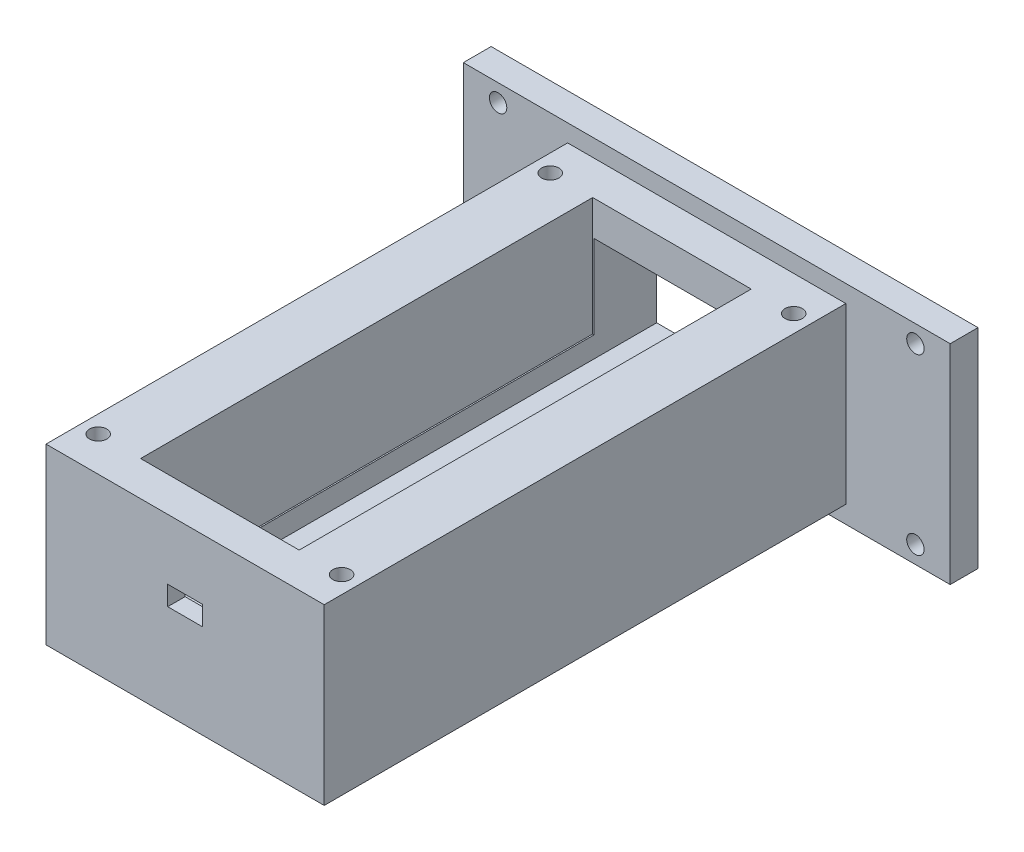
ISO-10303-21;
HEADER;
FILE_DESCRIPTION(('STEP AP214'),'2;1');
FILE_NAME('part.step','',(''),(''),'','','');
FILE_SCHEMA(('AUTOMOTIVE_DESIGN { 1 0 10303 214 1 1 1 1 }'));
ENDSEC;
DATA;
#1=APPLICATION_CONTEXT('core data for automotive mechanical design processes');
#2=APPLICATION_PROTOCOL_DEFINITION('international standard','automotive_design',2000,#1);
#3=PRODUCT_CONTEXT('',#1,'mechanical');
#4=PRODUCT('Part','Part','',(#3));
#5=PRODUCT_RELATED_PRODUCT_CATEGORY('part','',(#4));
#6=PRODUCT_DEFINITION_FORMATION('','',#4);
#7=PRODUCT_DEFINITION_CONTEXT('part definition',#1,'design');
#8=PRODUCT_DEFINITION('design','',#6,#7);
#9=PRODUCT_DEFINITION_SHAPE('','',#8);
#10=(LENGTH_UNIT() NAMED_UNIT(*) SI_UNIT(.MILLI.,.METRE.));
#11=(NAMED_UNIT(*) PLANE_ANGLE_UNIT() SI_UNIT($,.RADIAN.));
#12=(NAMED_UNIT(*) SI_UNIT($,.STERADIAN.) SOLID_ANGLE_UNIT());
#13=UNCERTAINTY_MEASURE_WITH_UNIT(LENGTH_MEASURE(1.E-05),#10,'distance_accuracy_value','');
#14=(GEOMETRIC_REPRESENTATION_CONTEXT(3) GLOBAL_UNCERTAINTY_ASSIGNED_CONTEXT((#13)) GLOBAL_UNIT_ASSIGNED_CONTEXT((#10,
#11,#12)) REPRESENTATION_CONTEXT('',''));
#15=CARTESIAN_POINT('',(0.,0.,0.));
#16=DIRECTION('',(0.,0.,1.));
#17=DIRECTION('',(1.,0.,0.));
#18=AXIS2_PLACEMENT_3D('',#15,#16,#17);
#19=CARTESIAN_POINT('',(22.4109534045464,10.3125,76.5));
#20=DIRECTION('',(0.,1.,0.));
#21=DIRECTION('',(0.,0.,1.));
#22=AXIS2_PLACEMENT_3D('',#19,#20,#21);
#23=PLANE('',#22);
#24=DIRECTION('',(0.,0.,-1.));
#25=VECTOR('',#24,1.);
#26=CARTESIAN_POINT('',(22.4109534045464,10.3125,76.5));
#27=LINE('',#26,#25);
#28=CARTESIAN_POINT('',(22.4109534045464,10.3125,8.99999999999999));
#29=VERTEX_POINT('',#28);
#30=CARTESIAN_POINT('',(22.4109534045464,10.3125,0.));
#31=VERTEX_POINT('',#30);
#32=EDGE_CURVE('E334',#29,#31,#27,.T.);
#33=ORIENTED_EDGE('',*,*,#32,.F.);
#34=DIRECTION('',(-1.,0.,0.));
#35=VECTOR('',#34,1.);
#36=CARTESIAN_POINT('',(22.4109534045464,10.3125,8.99999999999999));
#37=LINE('',#36,#35);
#38=CARTESIAN_POINT('',(0.0109534045463731,10.3125,8.99999999999999));
#39=VERTEX_POINT('',#38);
#40=EDGE_CURVE('E300',#29,#39,#37,.T.);
#41=ORIENTED_EDGE('',*,*,#40,.T.);
#42=DIRECTION('',(0.,0.,-1.));
#43=VECTOR('',#42,1.);
#44=CARTESIAN_POINT('',(0.0109534045463731,10.3125,76.5));
#45=LINE('',#44,#43);
#46=CARTESIAN_POINT('',(0.0109534045463731,10.3125,0.));
#47=VERTEX_POINT('',#46);
#48=EDGE_CURVE('E338',#39,#47,#45,.T.);
#49=ORIENTED_EDGE('',*,*,#48,.T.);
#50=DIRECTION('',(1.,0.,0.));
#51=VECTOR('',#50,1.);
#52=CARTESIAN_POINT('',(22.4109534045464,10.3125,0.));
#53=LINE('',#52,#51);
#54=EDGE_CURVE('E311',#47,#31,#53,.T.);
#55=ORIENTED_EDGE('',*,*,#54,.T.);
#56=EDGE_LOOP('',(#33,#41,#49,#55));
#57=FACE_BOUND('',#56,.T.);
#58=ADVANCED_FACE('F43',(#57),#23,.F.);
#59=CARTESIAN_POINT('',(46.2109534045464,0.,4.));
#60=DIRECTION('',(1.,0.,0.));
#61=DIRECTION('',(0.,0.,-1.));
#62=AXIS2_PLACEMENT_3D('',#59,#60,#61);
#63=PLANE('',#62);
#64=DIRECTION('',(0.,-1.,0.));
#65=VECTOR('',#64,1.);
#66=CARTESIAN_POINT('',(46.2109534045464,0.,0.));
#67=LINE('',#66,#65);
#68=CARTESIAN_POINT('',(46.2109534045464,17.8125,0.));
#69=VERTEX_POINT('',#68);
#70=CARTESIAN_POINT('',(46.2109534045464,-12.1875,0.));
#71=VERTEX_POINT('',#70);
#72=EDGE_CURVE('E375',#69,#71,#67,.T.);
#73=ORIENTED_EDGE('',*,*,#72,.F.);
#74=DIRECTION('',(0.,0.,-1.));
#75=VECTOR('',#74,1.);
#76=CARTESIAN_POINT('',(46.2109534045464,17.8125,4.));
#77=LINE('',#76,#75);
#78=CARTESIAN_POINT('',(46.2109534045464,17.8125,4.));
#79=VERTEX_POINT('',#78);
#80=EDGE_CURVE('E403',#79,#69,#77,.T.);
#81=ORIENTED_EDGE('',*,*,#80,.F.);
#82=DIRECTION('',(0.,-1.,0.));
#83=VECTOR('',#82,1.);
#84=CARTESIAN_POINT('',(46.2109534045464,0.,4.));
#85=LINE('',#84,#83);
#86=CARTESIAN_POINT('',(46.2109534045464,-12.1875,4.));
#87=VERTEX_POINT('',#86);
#88=EDGE_CURVE('E376',#79,#87,#85,.T.);
#89=ORIENTED_EDGE('',*,*,#88,.T.);
#90=DIRECTION('',(0.,0.,-1.));
#91=VECTOR('',#90,1.);
#92=CARTESIAN_POINT('',(46.2109534045464,-12.1875,4.));
#93=LINE('',#92,#91);
#94=EDGE_CURVE('E387',#87,#71,#93,.T.);
#95=ORIENTED_EDGE('',*,*,#94,.T.);
#96=EDGE_LOOP('',(#73,#81,#89,#95));
#97=FACE_BOUND('',#96,.T.);
#98=ADVANCED_FACE('F45',(#97),#63,.T.);
#99=CARTESIAN_POINT('',(0.,17.8125,4.));
#100=DIRECTION('',(0.,1.,0.));
#101=DIRECTION('',(0.,0.,1.));
#102=AXIS2_PLACEMENT_3D('',#99,#100,#101);
#103=PLANE('',#102);
#104=DIRECTION('',(1.,0.,0.));
#105=VECTOR('',#104,1.);
#106=CARTESIAN_POINT('',(0.,17.8125,0.));
#107=LINE('',#106,#105);
#108=CARTESIAN_POINT('',(-23.7890465954536,17.8125,0.));
#109=VERTEX_POINT('',#108);
#110=EDGE_CURVE('E390',#109,#69,#107,.T.);
#111=ORIENTED_EDGE('',*,*,#110,.F.);
#112=DIRECTION('',(0.,0.,-1.));
#113=VECTOR('',#112,1.);
#114=CARTESIAN_POINT('',(-23.7890465954536,17.8125,4.));
#115=LINE('',#114,#113);
#116=CARTESIAN_POINT('',(-23.7890465954536,17.8125,4.));
#117=VERTEX_POINT('',#116);
#118=EDGE_CURVE('E401',#117,#109,#115,.T.);
#119=ORIENTED_EDGE('',*,*,#118,.F.);
#120=DIRECTION('',(1.,0.,0.));
#121=VECTOR('',#120,1.);
#122=CARTESIAN_POINT('',(0.,17.8125,4.));
#123=LINE('',#122,#121);
#124=EDGE_CURVE('E379',#117,#79,#123,.T.);
#125=ORIENTED_EDGE('',*,*,#124,.T.);
#126=ORIENTED_EDGE('',*,*,#80,.T.);
#127=EDGE_LOOP('',(#111,#119,#125,#126));
#128=FACE_BOUND('',#127,.T.);
#129=ADVANCED_FACE('F483',(#128),#103,.T.);
#130=CARTESIAN_POINT('',(-23.7890465954536,0.,4.));
#131=DIRECTION('',(1.,0.,0.));
#132=DIRECTION('',(0.,1.,0.));
#133=AXIS2_PLACEMENT_3D('',#130,#131,#132);
#134=PLANE('',#133);
#135=DIRECTION('',(0.,-1.,0.));
#136=VECTOR('',#135,1.);
#137=CARTESIAN_POINT('',(-23.7890465954536,0.,0.));
#138=LINE('',#137,#136);
#139=CARTESIAN_POINT('',(-23.7890465954536,-12.1875,0.));
#140=VERTEX_POINT('',#139);
#141=EDGE_CURVE('E393',#109,#140,#138,.T.);
#142=ORIENTED_EDGE('',*,*,#141,.T.);
#143=DIRECTION('',(0.,0.,-1.));
#144=VECTOR('',#143,1.);
#145=CARTESIAN_POINT('',(-23.7890465954536,-12.1875,4.));
#146=LINE('',#145,#144);
#147=CARTESIAN_POINT('',(-23.7890465954536,-12.1875,4.));
#148=VERTEX_POINT('',#147);
#149=EDGE_CURVE('E398',#148,#140,#146,.T.);
#150=ORIENTED_EDGE('',*,*,#149,.F.);
#151=DIRECTION('',(0.,-1.,0.));
#152=VECTOR('',#151,1.);
#153=CARTESIAN_POINT('',(-23.7890465954536,0.,4.));
#154=LINE('',#153,#152);
#155=EDGE_CURVE('E383',#117,#148,#154,.T.);
#156=ORIENTED_EDGE('',*,*,#155,.F.);
#157=ORIENTED_EDGE('',*,*,#118,.T.);
#158=EDGE_LOOP('',(#142,#150,#156,#157));
#159=FACE_BOUND('',#158,.T.);
#160=ADVANCED_FACE('F480',(#159),#134,.F.);
#161=CARTESIAN_POINT('',(0.,-12.1875,4.));
#162=DIRECTION('',(0.,1.,0.));
#163=DIRECTION('',(0.,0.,1.));
#164=AXIS2_PLACEMENT_3D('',#161,#162,#163);
#165=PLANE('',#164);
#166=DIRECTION('',(1.,0.,0.));
#167=VECTOR('',#166,1.);
#168=CARTESIAN_POINT('',(0.,-12.1875,0.));
#169=LINE('',#168,#167);
#170=EDGE_CURVE('E380',#140,#71,#169,.T.);
#171=ORIENTED_EDGE('',*,*,#170,.T.);
#172=ORIENTED_EDGE('',*,*,#94,.F.);
#173=DIRECTION('',(1.,0.,0.));
#174=VECTOR('',#173,1.);
#175=CARTESIAN_POINT('',(0.,-12.1875,4.));
#176=LINE('',#175,#174);
#177=EDGE_CURVE('E385',#148,#87,#176,.T.);
#178=ORIENTED_EDGE('',*,*,#177,.F.);
#179=ORIENTED_EDGE('',*,*,#149,.T.);
#180=EDGE_LOOP('',(#171,#172,#178,#179));
#181=FACE_BOUND('',#180,.T.);
#182=ADVANCED_FACE('F476',(#181),#165,.F.);
#183=CARTESIAN_POINT('',(0.,0.,4.));
#184=DIRECTION('',(0.,0.,1.));
#185=DIRECTION('',(1.,0.,0.));
#186=AXIS2_PLACEMENT_3D('',#183,#184,#185);
#187=PLANE('',#186);
#188=CARTESIAN_POINT('',(41.2109534045464,-9.6875,4.));
#189=DIRECTION('',(0.,0.,1.));
#190=DIRECTION('',(1.,0.,0.));
#191=AXIS2_PLACEMENT_3D('',#188,#189,#190);
#192=CIRCLE('',#191,1.25);
#193=CARTESIAN_POINT('',(42.4609534045464,-9.6875,4.));
#194=VERTEX_POINT('',#193);
#195=EDGE_CURVE('E426',#194,#194,#192,.T.);
#196=ORIENTED_EDGE('',*,*,#195,.F.);
#197=EDGE_LOOP('',(#196));
#198=FACE_BOUND('',#197,.T.);
#199=CARTESIAN_POINT('',(-18.7890465954536,-9.68749999999999,4.));
#200=DIRECTION('',(0.,0.,1.));
#201=DIRECTION('',(1.,0.,0.));
#202=AXIS2_PLACEMENT_3D('',#199,#200,#201);
#203=CIRCLE('',#202,1.25);
#204=CARTESIAN_POINT('',(-17.5390465954536,-9.68749999999999,4.));
#205=VERTEX_POINT('',#204);
#206=EDGE_CURVE('E428',#205,#205,#203,.T.);
#207=ORIENTED_EDGE('',*,*,#206,.F.);
#208=EDGE_LOOP('',(#207));
#209=FACE_BOUND('',#208,.T.);
#210=CARTESIAN_POINT('',(-18.7890465954536,15.3125,4.));
#211=DIRECTION('',(0.,0.,1.));
#212=DIRECTION('',(1.,0.,0.));
#213=AXIS2_PLACEMENT_3D('',#210,#211,#212);
#214=CIRCLE('',#213,1.25);
#215=CARTESIAN_POINT('',(-17.5390465954536,15.3125,4.));
#216=VERTEX_POINT('',#215);
#217=EDGE_CURVE('E433',#216,#216,#214,.T.);
#218=ORIENTED_EDGE('',*,*,#217,.F.);
#219=EDGE_LOOP('',(#218));
#220=FACE_BOUND('',#219,.T.);
#221=CARTESIAN_POINT('',(41.2109534045464,15.3125,4.));
#222=DIRECTION('',(0.,0.,1.));
#223=DIRECTION('',(1.,0.,0.));
#224=AXIS2_PLACEMENT_3D('',#221,#222,#223);
#225=CIRCLE('',#224,1.25);
#226=CARTESIAN_POINT('',(42.4609534045464,15.3125,4.));
#227=VERTEX_POINT('',#226);
#228=EDGE_CURVE('E436',#227,#227,#225,.T.);
#229=ORIENTED_EDGE('',*,*,#228,.F.);
#230=EDGE_LOOP('',(#229));
#231=FACE_BOUND('',#230,.T.);
#232=DIRECTION('',(0.,-1.,0.));
#233=VECTOR('',#232,1.);
#234=CARTESIAN_POINT('',(-8.78904659545363,15.3125,4.));
#235=LINE('',#234,#233);
#236=CARTESIAN_POINT('',(-8.78904659545363,15.3125,4.));
#237=VERTEX_POINT('',#236);
#238=CARTESIAN_POINT('',(-8.78904659545362,-9.6875,4.));
#239=VERTEX_POINT('',#238);
#240=EDGE_CURVE('E333',#237,#239,#235,.T.);
#241=ORIENTED_EDGE('',*,*,#240,.F.);
#242=DIRECTION('',(-1.,0.,0.));
#243=VECTOR('',#242,1.);
#244=CARTESIAN_POINT('',(-8.78904659545363,15.3125,4.));
#245=LINE('',#244,#243);
#246=CARTESIAN_POINT('',(31.2109534045464,15.3125,4.));
#247=VERTEX_POINT('',#246);
#248=EDGE_CURVE('E347',#247,#237,#245,.T.);
#249=ORIENTED_EDGE('',*,*,#248,.F.);
#250=DIRECTION('',(0.,1.,0.));
#251=VECTOR('',#250,1.);
#252=CARTESIAN_POINT('',(31.2109534045464,15.3125,4.));
#253=LINE('',#252,#251);
#254=CARTESIAN_POINT('',(31.2109534045464,-9.6875,4.));
#255=VERTEX_POINT('',#254);
#256=EDGE_CURVE('E359',#255,#247,#253,.T.);
#257=ORIENTED_EDGE('',*,*,#256,.F.);
#258=DIRECTION('',(1.,0.,0.));
#259=VECTOR('',#258,1.);
#260=CARTESIAN_POINT('',(-8.78904659545362,-9.6875,4.));
#261=LINE('',#260,#259);
#262=EDGE_CURVE('E356',#239,#255,#261,.T.);
#263=ORIENTED_EDGE('',*,*,#262,.F.);
#264=EDGE_LOOP('',(#241,#249,#257,#263));
#265=FACE_BOUND('',#264,.T.);
#266=ORIENTED_EDGE('',*,*,#88,.F.);
#267=ORIENTED_EDGE('',*,*,#124,.F.);
#268=ORIENTED_EDGE('',*,*,#155,.T.);
#269=ORIENTED_EDGE('',*,*,#177,.T.);
#270=EDGE_LOOP('',(#266,#267,#268,#269));
#271=FACE_BOUND('',#270,.T.);
#272=ADVANCED_FACE('F458',(#198,#209,#220,#231,#265,#271),#187,.T.);
#273=CARTESIAN_POINT('',(0.,0.,0.));
#274=DIRECTION('',(0.,0.,1.));
#275=DIRECTION('',(1.,0.,0.));
#276=AXIS2_PLACEMENT_3D('',#273,#274,#275);
#277=PLANE('',#276);
#278=CARTESIAN_POINT('',(41.2109534045464,-9.6875,0.));
#279=DIRECTION('',(0.,0.,-1.));
#280=DIRECTION('',(1.,0.,0.));
#281=AXIS2_PLACEMENT_3D('',#278,#279,#280);
#282=CIRCLE('',#281,1.25);
#283=CARTESIAN_POINT('',(42.4609534045464,-9.6875,0.));
#284=VERTEX_POINT('',#283);
#285=EDGE_CURVE('E443',#284,#284,#282,.T.);
#286=ORIENTED_EDGE('',*,*,#285,.F.);
#287=EDGE_LOOP('',(#286));
#288=FACE_BOUND('',#287,.T.);
#289=CARTESIAN_POINT('',(-18.7890465954536,-9.68749999999999,0.));
#290=DIRECTION('',(0.,0.,-1.));
#291=DIRECTION('',(-1.,0.,0.));
#292=AXIS2_PLACEMENT_3D('',#289,#290,#291);
#293=CIRCLE('',#292,1.25);
#294=CARTESIAN_POINT('',(-20.0390465954536,-9.68749999999999,0.));
#295=VERTEX_POINT('',#294);
#296=EDGE_CURVE('E446',#295,#295,#293,.T.);
#297=ORIENTED_EDGE('',*,*,#296,.F.);
#298=EDGE_LOOP('',(#297));
#299=FACE_BOUND('',#298,.T.);
#300=CARTESIAN_POINT('',(-18.7890465954536,15.3125,0.));
#301=DIRECTION('',(0.,0.,-1.));
#302=DIRECTION('',(1.,0.,0.));
#303=AXIS2_PLACEMENT_3D('',#300,#301,#302);
#304=CIRCLE('',#303,1.25);
#305=CARTESIAN_POINT('',(-17.5390465954536,15.3125,0.));
#306=VERTEX_POINT('',#305);
#307=EDGE_CURVE('E442',#306,#306,#304,.T.);
#308=ORIENTED_EDGE('',*,*,#307,.F.);
#309=EDGE_LOOP('',(#308));
#310=FACE_BOUND('',#309,.T.);
#311=CARTESIAN_POINT('',(41.2109534045464,15.3125,0.));
#312=DIRECTION('',(0.,0.,-1.));
#313=DIRECTION('',(-1.,0.,0.));
#314=AXIS2_PLACEMENT_3D('',#311,#312,#313);
#315=CIRCLE('',#314,1.25);
#316=CARTESIAN_POINT('',(39.9609534045464,15.3125,0.));
#317=VERTEX_POINT('',#316);
#318=EDGE_CURVE('E439',#317,#317,#315,.T.);
#319=ORIENTED_EDGE('',*,*,#318,.F.);
#320=EDGE_LOOP('',(#319));
#321=FACE_BOUND('',#320,.T.);
#322=DIRECTION('',(-1.,0.,0.));
#323=VECTOR('',#322,1.);
#324=CARTESIAN_POINT('',(22.4109534045464,-4.6875,0.));
#325=LINE('',#324,#323);
#326=CARTESIAN_POINT('',(22.4109534045464,-4.6875,0.));
#327=VERTEX_POINT('',#326);
#328=CARTESIAN_POINT('',(0.0109534045463697,-4.6875,0.));
#329=VERTEX_POINT('',#328);
#330=EDGE_CURVE('E322',#327,#329,#325,.T.);
#331=ORIENTED_EDGE('',*,*,#330,.F.);
#332=DIRECTION('',(0.,-1.,0.));
#333=VECTOR('',#332,1.);
#334=CARTESIAN_POINT('',(22.4109534045464,10.3125,0.));
#335=LINE('',#334,#333);
#336=EDGE_CURVE('E306',#31,#327,#335,.T.);
#337=ORIENTED_EDGE('',*,*,#336,.F.);
#338=ORIENTED_EDGE('',*,*,#54,.F.);
#339=DIRECTION('',(0.,1.,0.));
#340=VECTOR('',#339,1.);
#341=CARTESIAN_POINT('',(0.0109534045463731,10.3125,0.));
#342=LINE('',#341,#340);
#343=EDGE_CURVE('E325',#329,#47,#342,.T.);
#344=ORIENTED_EDGE('',*,*,#343,.F.);
#345=EDGE_LOOP('',(#331,#337,#338,#344));
#346=FACE_BOUND('',#345,.T.);
#347=ORIENTED_EDGE('',*,*,#72,.T.);
#348=ORIENTED_EDGE('',*,*,#170,.F.);
#349=ORIENTED_EDGE('',*,*,#141,.F.);
#350=ORIENTED_EDGE('',*,*,#110,.T.);
#351=EDGE_LOOP('',(#347,#348,#349,#350));
#352=FACE_BOUND('',#351,.T.);
#353=ADVANCED_FACE('F454',(#288,#299,#310,#321,#346,#352),#277,.F.);
#354=CARTESIAN_POINT('',(-8.78904659545363,15.3125,79.));
#355=DIRECTION('',(1.,0.,0.));
#356=DIRECTION('',(0.,1.,0.));
#357=AXIS2_PLACEMENT_3D('',#354,#355,#356);
#358=PLANE('',#357);
#359=ORIENTED_EDGE('',*,*,#240,.T.);
#360=DIRECTION('',(0.,0.,-1.));
#361=VECTOR('',#360,1.);
#362=CARTESIAN_POINT('',(-8.78904659545362,-9.6875,79.));
#363=LINE('',#362,#361);
#364=CARTESIAN_POINT('',(-8.78904659545362,-9.6875,79.));
#365=VERTEX_POINT('',#364);
#366=EDGE_CURVE('E372',#365,#239,#363,.T.);
#367=ORIENTED_EDGE('',*,*,#366,.F.);
#368=DIRECTION('',(0.,-1.,0.));
#369=VECTOR('',#368,1.);
#370=CARTESIAN_POINT('',(-8.78904659545363,15.3125,79.));
#371=LINE('',#370,#369);
#372=CARTESIAN_POINT('',(-8.78904659545363,15.3125,79.));
#373=VERTEX_POINT('',#372);
#374=EDGE_CURVE('E343',#373,#365,#371,.T.);
#375=ORIENTED_EDGE('',*,*,#374,.F.);
#376=DIRECTION('',(0.,0.,-1.));
#377=VECTOR('',#376,1.);
#378=CARTESIAN_POINT('',(-8.78904659545363,15.3125,79.));
#379=LINE('',#378,#377);
#380=EDGE_CURVE('E353',#373,#237,#379,.T.);
#381=ORIENTED_EDGE('',*,*,#380,.T.);
#382=EDGE_LOOP('',(#359,#367,#375,#381));
#383=FACE_BOUND('',#382,.T.);
#384=ADVANCED_FACE('F457',(#383),#358,.F.);
#385=CARTESIAN_POINT('',(-8.78904659545362,-9.6875,79.));
#386=DIRECTION('',(0.,1.,0.));
#387=DIRECTION('',(0.,0.,1.));
#388=AXIS2_PLACEMENT_3D('',#385,#386,#387);
#389=PLANE('',#388);
#390=CARTESIAN_POINT('',(11.2109534045464,-9.6875,59.));
#391=DIRECTION('',(0.,-1.,0.));
#392=DIRECTION('',(0.,0.,-1.));
#393=AXIS2_PLACEMENT_3D('',#390,#391,#392);
#394=CIRCLE('',#393,2.9);
#395=CARTESIAN_POINT('',(11.2109534045464,-9.6875,56.1));
#396=VERTEX_POINT('',#395);
#397=EDGE_CURVE('E229',#396,#396,#394,.T.);
#398=ORIENTED_EDGE('',*,*,#397,.F.);
#399=EDGE_LOOP('',(#398));
#400=FACE_BOUND('',#399,.T.);
#401=CARTESIAN_POINT('',(28.7109534045464,-9.6875,9.));
#402=DIRECTION('',(0.,1.,0.));
#403=DIRECTION('',(0.,0.,1.));
#404=AXIS2_PLACEMENT_3D('',#401,#402,#403);
#405=CIRCLE('',#404,1.25);
#406=CARTESIAN_POINT('',(28.7109534045464,-9.6875,10.25));
#407=VERTEX_POINT('',#406);
#408=EDGE_CURVE('E256',#407,#407,#405,.T.);
#409=ORIENTED_EDGE('',*,*,#408,.T.);
#410=EDGE_LOOP('',(#409));
#411=FACE_BOUND('',#410,.T.);
#412=CARTESIAN_POINT('',(-6.28904659545363,-9.6875,74.));
#413=DIRECTION('',(0.,1.,0.));
#414=DIRECTION('',(0.,0.,1.));
#415=AXIS2_PLACEMENT_3D('',#412,#413,#414);
#416=CIRCLE('',#415,1.25);
#417=CARTESIAN_POINT('',(-6.28904659545363,-9.6875,75.25));
#418=VERTEX_POINT('',#417);
#419=EDGE_CURVE('E253',#418,#418,#416,.T.);
#420=ORIENTED_EDGE('',*,*,#419,.T.);
#421=EDGE_LOOP('',(#420));
#422=FACE_BOUND('',#421,.T.);
#423=CARTESIAN_POINT('',(28.7109534045464,-9.6875,74.));
#424=DIRECTION('',(0.,1.,0.));
#425=DIRECTION('',(0.,0.,1.));
#426=AXIS2_PLACEMENT_3D('',#423,#424,#425);
#427=CIRCLE('',#426,1.25);
#428=CARTESIAN_POINT('',(28.7109534045464,-9.6875,75.25));
#429=VERTEX_POINT('',#428);
#430=EDGE_CURVE('E250',#429,#429,#427,.T.);
#431=ORIENTED_EDGE('',*,*,#430,.T.);
#432=EDGE_LOOP('',(#431));
#433=FACE_BOUND('',#432,.T.);
#434=CARTESIAN_POINT('',(-6.28904659545363,-9.6875,9.));
#435=DIRECTION('',(0.,1.,0.));
#436=DIRECTION('',(0.,0.,1.));
#437=AXIS2_PLACEMENT_3D('',#434,#435,#436);
#438=CIRCLE('',#437,1.25);
#439=CARTESIAN_POINT('',(-6.28904659545363,-9.6875,10.25));
#440=VERTEX_POINT('',#439);
#441=EDGE_CURVE('E247',#440,#440,#438,.T.);
#442=ORIENTED_EDGE('',*,*,#441,.T.);
#443=EDGE_LOOP('',(#442));
#444=FACE_BOUND('',#443,.T.);
#445=ORIENTED_EDGE('',*,*,#262,.T.);
#446=DIRECTION('',(0.,0.,-1.));
#447=VECTOR('',#446,1.);
#448=CARTESIAN_POINT('',(31.2109534045464,-9.6875,79.));
#449=LINE('',#448,#447);
#450=CARTESIAN_POINT('',(31.2109534045464,-9.6875,79.));
#451=VERTEX_POINT('',#450);
#452=EDGE_CURVE('E369',#451,#255,#449,.T.);
#453=ORIENTED_EDGE('',*,*,#452,.F.);
#454=DIRECTION('',(1.,0.,0.));
#455=VECTOR('',#454,1.);
#456=CARTESIAN_POINT('',(-8.78904659545362,-9.6875,79.));
#457=LINE('',#456,#455);
#458=EDGE_CURVE('E346',#365,#451,#457,.T.);
#459=ORIENTED_EDGE('',*,*,#458,.F.);
#460=ORIENTED_EDGE('',*,*,#366,.T.);
#461=EDGE_LOOP('',(#445,#453,#459,#460));
#462=FACE_BOUND('',#461,.T.);
#463=ADVANCED_FACE('F591',(#400,#411,#422,#433,#444,#462),#389,.F.);
#464=CARTESIAN_POINT('',(31.2109534045464,15.3125,79.));
#465=DIRECTION('',(-1.,0.,0.));
#466=DIRECTION('',(0.,-1.,0.));
#467=AXIS2_PLACEMENT_3D('',#464,#465,#466);
#468=PLANE('',#467);
#469=ORIENTED_EDGE('',*,*,#256,.T.);
#470=DIRECTION('',(0.,0.,-1.));
#471=VECTOR('',#470,1.);
#472=CARTESIAN_POINT('',(31.2109534045464,15.3125,79.));
#473=LINE('',#472,#471);
#474=CARTESIAN_POINT('',(31.2109534045464,15.3125,79.));
#475=VERTEX_POINT('',#474);
#476=EDGE_CURVE('E366',#475,#247,#473,.T.);
#477=ORIENTED_EDGE('',*,*,#476,.F.);
#478=DIRECTION('',(0.,1.,0.));
#479=VECTOR('',#478,1.);
#480=CARTESIAN_POINT('',(31.2109534045464,15.3125,79.));
#481=LINE('',#480,#479);
#482=EDGE_CURVE('E349',#451,#475,#481,.T.);
#483=ORIENTED_EDGE('',*,*,#482,.F.);
#484=ORIENTED_EDGE('',*,*,#452,.T.);
#485=EDGE_LOOP('',(#469,#477,#483,#484));
#486=FACE_BOUND('',#485,.T.);
#487=ADVANCED_FACE('F588',(#486),#468,.F.);
#488=CARTESIAN_POINT('',(-8.78904659545363,15.3125,79.));
#489=DIRECTION('',(0.,-1.,0.));
#490=DIRECTION('',(0.,0.,-1.));
#491=AXIS2_PLACEMENT_3D('',#488,#489,#490);
#492=PLANE('',#491);
#493=CARTESIAN_POINT('',(28.7109534045464,15.3125,9.));
#494=DIRECTION('',(0.,1.,0.));
#495=DIRECTION('',(0.,0.,1.));
#496=AXIS2_PLACEMENT_3D('',#493,#494,#495);
#497=CIRCLE('',#496,1.25);
#498=CARTESIAN_POINT('',(28.7109534045464,15.3125,10.25));
#499=VERTEX_POINT('',#498);
#500=EDGE_CURVE('E239',#499,#499,#497,.T.);
#501=ORIENTED_EDGE('',*,*,#500,.F.);
#502=EDGE_LOOP('',(#501));
#503=FACE_BOUND('',#502,.T.);
#504=CARTESIAN_POINT('',(-6.28904659545363,15.3125,74.));
#505=DIRECTION('',(0.,1.,0.));
#506=DIRECTION('',(0.,0.,1.));
#507=AXIS2_PLACEMENT_3D('',#504,#505,#506);
#508=CIRCLE('',#507,1.25);
#509=CARTESIAN_POINT('',(-6.28904659545363,15.3125,75.25));
#510=VERTEX_POINT('',#509);
#511=EDGE_CURVE('E238',#510,#510,#508,.T.);
#512=ORIENTED_EDGE('',*,*,#511,.F.);
#513=EDGE_LOOP('',(#512));
#514=FACE_BOUND('',#513,.T.);
#515=CARTESIAN_POINT('',(28.7109534045464,15.3125,74.));
#516=DIRECTION('',(0.,1.,0.));
#517=DIRECTION('',(0.,0.,1.));
#518=AXIS2_PLACEMENT_3D('',#515,#516,#517);
#519=CIRCLE('',#518,1.25);
#520=CARTESIAN_POINT('',(28.7109534045464,15.3125,75.25));
#521=VERTEX_POINT('',#520);
#522=EDGE_CURVE('E235',#521,#521,#519,.T.);
#523=ORIENTED_EDGE('',*,*,#522,.F.);
#524=EDGE_LOOP('',(#523));
#525=FACE_BOUND('',#524,.T.);
#526=CARTESIAN_POINT('',(-6.28904659545363,15.3125,9.));
#527=DIRECTION('',(0.,1.,0.));
#528=DIRECTION('',(0.,0.,1.));
#529=AXIS2_PLACEMENT_3D('',#526,#527,#528);
#530=CIRCLE('',#529,1.25);
#531=CARTESIAN_POINT('',(-6.28904659545363,15.3125,10.25));
#532=VERTEX_POINT('',#531);
#533=EDGE_CURVE('E242',#532,#532,#530,.T.);
#534=ORIENTED_EDGE('',*,*,#533,.F.);
#535=EDGE_LOOP('',(#534));
#536=FACE_BOUND('',#535,.T.);
#537=DIRECTION('',(1.,0.,0.));
#538=VECTOR('',#537,1.);
#539=CARTESIAN_POINT('',(-0.189046595453605,15.3125,74.));
#540=LINE('',#539,#538);
#541=CARTESIAN_POINT('',(-0.189046595453605,15.3125,74.));
#542=VERTEX_POINT('',#541);
#543=CARTESIAN_POINT('',(22.6109534045464,15.3125,74.));
#544=VERTEX_POINT('',#543);
#545=EDGE_CURVE('E276',#542,#544,#540,.T.);
#546=ORIENTED_EDGE('',*,*,#545,.F.);
#547=DIRECTION('',(0.,0.,1.));
#548=VECTOR('',#547,1.);
#549=CARTESIAN_POINT('',(-0.189046595453613,15.3125,8.99999999999999));
#550=LINE('',#549,#548);
#551=CARTESIAN_POINT('',(-0.189046595453613,15.3125,8.99999999999999));
#552=VERTEX_POINT('',#551);
#553=EDGE_CURVE('E259',#552,#542,#550,.T.);
#554=ORIENTED_EDGE('',*,*,#553,.F.);
#555=DIRECTION('',(-1.,0.,0.));
#556=VECTOR('',#555,1.);
#557=CARTESIAN_POINT('',(-0.189046595453613,15.3125,8.99999999999999));
#558=LINE('',#557,#556);
#559=CARTESIAN_POINT('',(22.6109534045464,15.3125,8.99999999999999));
#560=VERTEX_POINT('',#559);
#561=EDGE_CURVE('E264',#560,#552,#558,.T.);
#562=ORIENTED_EDGE('',*,*,#561,.F.);
#563=DIRECTION('',(0.,0.,-1.));
#564=VECTOR('',#563,1.);
#565=CARTESIAN_POINT('',(22.6109534045464,15.3125,8.99999999999999));
#566=LINE('',#565,#564);
#567=EDGE_CURVE('E279',#544,#560,#566,.T.);
#568=ORIENTED_EDGE('',*,*,#567,.F.);
#569=EDGE_LOOP('',(#546,#554,#562,#568));
#570=FACE_BOUND('',#569,.T.);
#571=ORIENTED_EDGE('',*,*,#248,.T.);
#572=ORIENTED_EDGE('',*,*,#380,.F.);
#573=DIRECTION('',(-1.,0.,0.));
#574=VECTOR('',#573,1.);
#575=CARTESIAN_POINT('',(-8.78904659545363,15.3125,79.));
#576=LINE('',#575,#574);
#577=EDGE_CURVE('E351',#475,#373,#576,.T.);
#578=ORIENTED_EDGE('',*,*,#577,.F.);
#579=ORIENTED_EDGE('',*,*,#476,.T.);
#580=EDGE_LOOP('',(#571,#572,#578,#579));
#581=FACE_BOUND('',#580,.T.);
#582=ADVANCED_FACE('F548',(#503,#514,#525,#536,#570,#581),#492,.F.);
#583=CARTESIAN_POINT('',(0.,0.,79.));
#584=DIRECTION('',(0.,0.,1.));
#585=DIRECTION('',(1.,0.,0.));
#586=AXIS2_PLACEMENT_3D('',#583,#584,#585);
#587=PLANE('',#586);
#588=DIRECTION('',(0.,-1.,0.));
#589=VECTOR('',#588,1.);
#590=CARTESIAN_POINT('',(8.71095340454637,6.6125,79.));
#591=LINE('',#590,#589);
#592=CARTESIAN_POINT('',(8.71095340454637,6.6125,79.));
#593=VERTEX_POINT('',#592);
#594=CARTESIAN_POINT('',(8.71095340454637,3.8125,79.));
#595=VERTEX_POINT('',#594);
#596=EDGE_CURVE('E58',#593,#595,#591,.T.);
#597=ORIENTED_EDGE('',*,*,#596,.F.);
#598=DIRECTION('',(-1.,0.,0.));
#599=VECTOR('',#598,1.);
#600=CARTESIAN_POINT('',(8.71095340454637,6.6125,79.));
#601=LINE('',#600,#599);
#602=CARTESIAN_POINT('',(13.7109534045464,6.6125,79.));
#603=VERTEX_POINT('',#602);
#604=EDGE_CURVE('E222',#603,#593,#601,.T.);
#605=ORIENTED_EDGE('',*,*,#604,.F.);
#606=DIRECTION('',(0.,1.,0.));
#607=VECTOR('',#606,1.);
#608=CARTESIAN_POINT('',(13.7109534045464,6.6125,79.));
#609=LINE('',#608,#607);
#610=CARTESIAN_POINT('',(13.7109534045464,3.8125,79.));
#611=VERTEX_POINT('',#610);
#612=EDGE_CURVE('E206',#611,#603,#609,.T.);
#613=ORIENTED_EDGE('',*,*,#612,.F.);
#614=DIRECTION('',(1.,0.,0.));
#615=VECTOR('',#614,1.);
#616=CARTESIAN_POINT('',(8.71095340454637,3.8125,79.));
#617=LINE('',#616,#615);
#618=EDGE_CURVE('E215',#595,#611,#617,.T.);
#619=ORIENTED_EDGE('',*,*,#618,.F.);
#620=EDGE_LOOP('',(#597,#605,#613,#619));
#621=FACE_BOUND('',#620,.T.);
#622=ORIENTED_EDGE('',*,*,#374,.T.);
#623=ORIENTED_EDGE('',*,*,#458,.T.);
#624=ORIENTED_EDGE('',*,*,#482,.T.);
#625=ORIENTED_EDGE('',*,*,#577,.T.);
#626=EDGE_LOOP('',(#622,#623,#624,#625));
#627=FACE_BOUND('',#626,.T.);
#628=ADVANCED_FACE('F219',(#621,#627),#587,.T.);
#629=CARTESIAN_POINT('',(22.4109534045464,10.3125,76.5));
#630=DIRECTION('',(1.,0.,0.));
#631=DIRECTION('',(0.,0.,-1.));
#632=AXIS2_PLACEMENT_3D('',#629,#630,#631);
#633=PLANE('',#632);
#634=DIRECTION('',(0.,0.,1.));
#635=VECTOR('',#634,1.);
#636=CARTESIAN_POINT('',(22.4109534045464,-1.6875,76.5));
#637=LINE('',#636,#635);
#638=CARTESIAN_POINT('',(22.4109534045464,-1.6875,8.99999999999999));
#639=VERTEX_POINT('',#638);
#640=CARTESIAN_POINT('',(22.4109534045464,-1.6875,74.));
#641=VERTEX_POINT('',#640);
#642=EDGE_CURVE('E286',#639,#641,#637,.T.);
#643=ORIENTED_EDGE('',*,*,#642,.F.);
#644=DIRECTION('',(0.,1.,0.));
#645=VECTOR('',#644,1.);
#646=CARTESIAN_POINT('',(22.4109534045464,10.3125,8.99999999999999));
#647=LINE('',#646,#645);
#648=EDGE_CURVE('E303',#639,#29,#647,.T.);
#649=ORIENTED_EDGE('',*,*,#648,.T.);
#650=ORIENTED_EDGE('',*,*,#32,.T.);
#651=ORIENTED_EDGE('',*,*,#336,.T.);
#652=DIRECTION('',(0.,0.,-1.));
#653=VECTOR('',#652,1.);
#654=CARTESIAN_POINT('',(22.4109534045464,-4.6875,76.5));
#655=LINE('',#654,#653);
#656=CARTESIAN_POINT('',(22.4109534045464,-4.6875,76.5));
#657=VERTEX_POINT('',#656);
#658=EDGE_CURVE('E320',#657,#327,#655,.T.);
#659=ORIENTED_EDGE('',*,*,#658,.F.);
#660=DIRECTION('',(0.,-1.,0.));
#661=VECTOR('',#660,1.);
#662=CARTESIAN_POINT('',(22.4109534045464,10.3125,76.5));
#663=LINE('',#662,#661);
#664=CARTESIAN_POINT('',(22.4109534045464,10.3125,76.5));
#665=VERTEX_POINT('',#664);
#666=EDGE_CURVE('E307',#665,#657,#663,.T.);
#667=ORIENTED_EDGE('',*,*,#666,.F.);
#668=CARTESIAN_POINT('',(22.4109534045464,10.3125,74.));
#669=VERTEX_POINT('',#668);
#670=EDGE_CURVE('E330',#665,#669,#27,.T.);
#671=ORIENTED_EDGE('',*,*,#670,.T.);
#672=DIRECTION('',(0.,-1.,0.));
#673=VECTOR('',#672,1.);
#674=CARTESIAN_POINT('',(22.4109534045464,10.3125,74.));
#675=LINE('',#674,#673);
#676=EDGE_CURVE('E297',#669,#641,#675,.T.);
#677=ORIENTED_EDGE('',*,*,#676,.T.);
#678=EDGE_LOOP('',(#643,#649,#650,#651,#659,#667,#671,#677));
#679=FACE_BOUND('',#678,.T.);
#680=ADVANCED_FACE('F510',(#679),#633,.F.);
#681=CARTESIAN_POINT('',(0.0109534045463731,10.3125,76.5));
#682=VERTEX_POINT('',#681);
#683=CARTESIAN_POINT('',(0.0109534045463731,10.3125,74.));
#684=VERTEX_POINT('',#683);
#685=EDGE_CURVE('E335',#682,#684,#45,.T.);
#686=ORIENTED_EDGE('',*,*,#685,.T.);
#687=DIRECTION('',(1.,0.,0.));
#688=VECTOR('',#687,1.);
#689=CARTESIAN_POINT('',(22.4109534045464,10.3125,74.));
#690=LINE('',#689,#688);
#691=EDGE_CURVE('E294',#684,#669,#690,.T.);
#692=ORIENTED_EDGE('',*,*,#691,.T.);
#693=ORIENTED_EDGE('',*,*,#670,.F.);
#694=DIRECTION('',(1.,0.,0.));
#695=VECTOR('',#694,1.);
#696=CARTESIAN_POINT('',(22.4109534045464,10.3125,76.5));
#697=LINE('',#696,#695);
#698=EDGE_CURVE('E317',#682,#665,#697,.T.);
#699=ORIENTED_EDGE('',*,*,#698,.F.);
#700=EDGE_LOOP('',(#686,#692,#693,#699));
#701=FACE_BOUND('',#700,.T.);
#702=ADVANCED_FACE('F499',(#701),#23,.F.);
#703=CARTESIAN_POINT('',(0.0109534045463731,10.3125,76.5));
#704=DIRECTION('',(-1.,0.,0.));
#705=DIRECTION('',(0.,-1.,0.));
#706=AXIS2_PLACEMENT_3D('',#703,#704,#705);
#707=PLANE('',#706);
#708=ORIENTED_EDGE('',*,*,#48,.F.);
#709=DIRECTION('',(0.,-1.,0.));
#710=VECTOR('',#709,1.);
#711=CARTESIAN_POINT('',(0.0109534045463731,10.3125,8.99999999999999));
#712=LINE('',#711,#710);
#713=CARTESIAN_POINT('',(0.0109534045463704,-1.6875,8.99999999999999));
#714=VERTEX_POINT('',#713);
#715=EDGE_CURVE('E410',#39,#714,#712,.T.);
#716=ORIENTED_EDGE('',*,*,#715,.T.);
#717=DIRECTION('',(0.,0.,-1.));
#718=VECTOR('',#717,1.);
#719=CARTESIAN_POINT('',(0.0109534045463704,-1.6875,76.5));
#720=LINE('',#719,#718);
#721=CARTESIAN_POINT('',(0.0109534045463704,-1.6875,74.));
#722=VERTEX_POINT('',#721);
#723=EDGE_CURVE('E405',#722,#714,#720,.T.);
#724=ORIENTED_EDGE('',*,*,#723,.F.);
#725=DIRECTION('',(0.,1.,0.));
#726=VECTOR('',#725,1.);
#727=CARTESIAN_POINT('',(0.0109534045463731,10.3125,74.));
#728=LINE('',#727,#726);
#729=EDGE_CURVE('E407',#722,#684,#728,.T.);
#730=ORIENTED_EDGE('',*,*,#729,.T.);
#731=ORIENTED_EDGE('',*,*,#685,.F.);
#732=DIRECTION('',(0.,1.,0.));
#733=VECTOR('',#732,1.);
#734=CARTESIAN_POINT('',(0.0109534045463731,10.3125,76.5));
#735=LINE('',#734,#733);
#736=CARTESIAN_POINT('',(0.0109534045463697,-4.6875,76.5));
#737=VERTEX_POINT('',#736);
#738=EDGE_CURVE('E314',#737,#682,#735,.T.);
#739=ORIENTED_EDGE('',*,*,#738,.F.);
#740=DIRECTION('',(0.,0.,-1.));
#741=VECTOR('',#740,1.);
#742=CARTESIAN_POINT('',(0.0109534045463697,-4.6875,76.5));
#743=LINE('',#742,#741);
#744=EDGE_CURVE('E339',#737,#329,#743,.T.);
#745=ORIENTED_EDGE('',*,*,#744,.T.);
#746=ORIENTED_EDGE('',*,*,#343,.T.);
#747=EDGE_LOOP('',(#708,#716,#724,#730,#731,#739,#745,#746));
#748=FACE_BOUND('',#747,.T.);
#749=ADVANCED_FACE('F509',(#748),#707,.F.);
#750=CARTESIAN_POINT('',(22.4109534045464,-4.6875,76.5));
#751=DIRECTION('',(0.,-1.,0.));
#752=DIRECTION('',(0.,0.,-1.));
#753=AXIS2_PLACEMENT_3D('',#750,#751,#752);
#754=PLANE('',#753);
#755=CARTESIAN_POINT('',(11.2109534045464,-4.6875,59.));
#756=DIRECTION('',(0.,-1.,0.));
#757=DIRECTION('',(0.,0.,-1.));
#758=AXIS2_PLACEMENT_3D('',#755,#756,#757);
#759=CIRCLE('',#758,2.9);
#760=CARTESIAN_POINT('',(11.2109534045464,-4.6875,56.1));
#761=VERTEX_POINT('',#760);
#762=EDGE_CURVE('E234',#761,#761,#759,.T.);
#763=ORIENTED_EDGE('',*,*,#762,.T.);
#764=EDGE_LOOP('',(#763));
#765=FACE_BOUND('',#764,.T.);
#766=ORIENTED_EDGE('',*,*,#330,.T.);
#767=ORIENTED_EDGE('',*,*,#744,.F.);
#768=DIRECTION('',(-1.,0.,0.));
#769=VECTOR('',#768,1.);
#770=CARTESIAN_POINT('',(22.4109534045464,-4.6875,76.5));
#771=LINE('',#770,#769);
#772=EDGE_CURVE('E310',#657,#737,#771,.T.);
#773=ORIENTED_EDGE('',*,*,#772,.F.);
#774=ORIENTED_EDGE('',*,*,#658,.T.);
#775=EDGE_LOOP('',(#766,#767,#773,#774));
#776=FACE_BOUND('',#775,.T.);
#777=ADVANCED_FACE('F515',(#765,#776),#754,.F.);
#778=CARTESIAN_POINT('',(0.,0.,76.5));
#779=DIRECTION('',(0.,0.,-1.));
#780=DIRECTION('',(-1.,0.,0.));
#781=AXIS2_PLACEMENT_3D('',#778,#779,#780);
#782=PLANE('',#781);
#783=DIRECTION('',(0.,1.,0.));
#784=VECTOR('',#783,1.);
#785=CARTESIAN_POINT('',(8.71095340454637,0.,76.5));
#786=LINE('',#785,#784);
#787=CARTESIAN_POINT('',(8.71095340454637,3.8125,76.5));
#788=VERTEX_POINT('',#787);
#789=CARTESIAN_POINT('',(8.71095340454637,6.6125,76.5));
#790=VERTEX_POINT('',#789);
#791=EDGE_CURVE('E11',#788,#790,#786,.T.);
#792=ORIENTED_EDGE('',*,*,#791,.F.);
#793=DIRECTION('',(-1.,0.,0.));
#794=VECTOR('',#793,1.);
#795=CARTESIAN_POINT('',(0.,3.8125,76.5));
#796=LINE('',#795,#794);
#797=CARTESIAN_POINT('',(13.7109534045464,3.8125,76.5));
#798=VERTEX_POINT('',#797);
#799=EDGE_CURVE('E413',#798,#788,#796,.T.);
#800=ORIENTED_EDGE('',*,*,#799,.F.);
#801=DIRECTION('',(0.,-1.,0.));
#802=VECTOR('',#801,1.);
#803=CARTESIAN_POINT('',(13.7109534045464,0.,76.5));
#804=LINE('',#803,#802);
#805=CARTESIAN_POINT('',(13.7109534045464,6.6125,76.5));
#806=VERTEX_POINT('',#805);
#807=EDGE_CURVE('E209',#806,#798,#804,.T.);
#808=ORIENTED_EDGE('',*,*,#807,.F.);
#809=DIRECTION('',(1.,0.,0.));
#810=VECTOR('',#809,1.);
#811=CARTESIAN_POINT('',(0.,6.61250000000001,76.5));
#812=LINE('',#811,#810);
#813=EDGE_CURVE('E51',#790,#806,#812,.T.);
#814=ORIENTED_EDGE('',*,*,#813,.F.);
#815=EDGE_LOOP('',(#792,#800,#808,#814));
#816=FACE_BOUND('',#815,.T.);
#817=ORIENTED_EDGE('',*,*,#666,.T.);
#818=ORIENTED_EDGE('',*,*,#772,.T.);
#819=ORIENTED_EDGE('',*,*,#738,.T.);
#820=ORIENTED_EDGE('',*,*,#698,.T.);
#821=EDGE_LOOP('',(#817,#818,#819,#820));
#822=FACE_BOUND('',#821,.T.);
#823=ADVANCED_FACE('F423',(#816,#822),#782,.T.);
#824=CARTESIAN_POINT('',(-0.189046595453613,-1.6875,8.99999999999999));
#825=DIRECTION('',(0.,0.,-1.));
#826=DIRECTION('',(-1.,0.,0.));
#827=AXIS2_PLACEMENT_3D('',#824,#825,#826);
#828=PLANE('',#827);
#829=DIRECTION('',(-1.,0.,0.));
#830=VECTOR('',#829,1.);
#831=CARTESIAN_POINT('',(-0.189046595453613,-1.6875,8.99999999999999));
#832=LINE('',#831,#830);
#833=CARTESIAN_POINT('',(22.6109534045464,-1.6875,8.99999999999999));
#834=VERTEX_POINT('',#833);
#835=EDGE_CURVE('E271',#834,#639,#832,.T.);
#836=ORIENTED_EDGE('',*,*,#835,.F.);
#837=DIRECTION('',(0.,1.,0.));
#838=VECTOR('',#837,1.);
#839=CARTESIAN_POINT('',(22.6109534045464,-1.6875,8.99999999999999));
#840=LINE('',#839,#838);
#841=EDGE_CURVE('E287',#834,#560,#840,.T.);
#842=ORIENTED_EDGE('',*,*,#841,.T.);
#843=ORIENTED_EDGE('',*,*,#561,.T.);
#844=DIRECTION('',(0.,1.,0.));
#845=VECTOR('',#844,1.);
#846=CARTESIAN_POINT('',(-0.189046595453613,-1.6875,8.99999999999999));
#847=LINE('',#846,#845);
#848=CARTESIAN_POINT('',(-0.189046595453613,-1.6875,8.99999999999999));
#849=VERTEX_POINT('',#848);
#850=EDGE_CURVE('E284',#849,#552,#847,.T.);
#851=ORIENTED_EDGE('',*,*,#850,.F.);
#852=EDGE_CURVE('E270',#714,#849,#832,.T.);
#853=ORIENTED_EDGE('',*,*,#852,.F.);
#854=ORIENTED_EDGE('',*,*,#715,.F.);
#855=ORIENTED_EDGE('',*,*,#40,.F.);
#856=ORIENTED_EDGE('',*,*,#648,.F.);
#857=EDGE_LOOP('',(#836,#842,#843,#851,#853,#854,#855,#856));
#858=FACE_BOUND('',#857,.T.);
#859=ADVANCED_FACE('F530',(#858),#828,.F.);
#860=CARTESIAN_POINT('',(-0.189046595453605,-1.6875,74.));
#861=DIRECTION('',(0.,0.,1.));
#862=DIRECTION('',(1.,0.,0.));
#863=AXIS2_PLACEMENT_3D('',#860,#861,#862);
#864=PLANE('',#863);
#865=ORIENTED_EDGE('',*,*,#691,.F.);
#866=ORIENTED_EDGE('',*,*,#729,.F.);
#867=DIRECTION('',(1.,0.,0.));
#868=VECTOR('',#867,1.);
#869=CARTESIAN_POINT('',(-0.189046595453605,-1.6875,74.));
#870=LINE('',#869,#868);
#871=CARTESIAN_POINT('',(-0.189046595453605,-1.6875,74.));
#872=VERTEX_POINT('',#871);
#873=EDGE_CURVE('E265',#872,#722,#870,.T.);
#874=ORIENTED_EDGE('',*,*,#873,.F.);
#875=DIRECTION('',(0.,1.,0.));
#876=VECTOR('',#875,1.);
#877=CARTESIAN_POINT('',(-0.189046595453605,-1.6875,74.));
#878=LINE('',#877,#876);
#879=EDGE_CURVE('E274',#872,#542,#878,.T.);
#880=ORIENTED_EDGE('',*,*,#879,.T.);
#881=ORIENTED_EDGE('',*,*,#545,.T.);
#882=DIRECTION('',(0.,1.,0.));
#883=VECTOR('',#882,1.);
#884=CARTESIAN_POINT('',(22.6109534045464,-1.6875,74.));
#885=LINE('',#884,#883);
#886=CARTESIAN_POINT('',(22.6109534045464,-1.6875,74.));
#887=VERTEX_POINT('',#886);
#888=EDGE_CURVE('E289',#887,#544,#885,.T.);
#889=ORIENTED_EDGE('',*,*,#888,.F.);
#890=EDGE_CURVE('E263',#641,#887,#870,.T.);
#891=ORIENTED_EDGE('',*,*,#890,.F.);
#892=ORIENTED_EDGE('',*,*,#676,.F.);
#893=EDGE_LOOP('',(#865,#866,#874,#880,#881,#889,#891,#892));
#894=FACE_BOUND('',#893,.T.);
#895=ADVANCED_FACE('F538',(#894),#864,.F.);
#896=CARTESIAN_POINT('',(0.,-1.6875,0.));
#897=DIRECTION('',(0.,1.,0.));
#898=DIRECTION('',(0.,0.,1.));
#899=AXIS2_PLACEMENT_3D('',#896,#897,#898);
#900=PLANE('',#899);
#901=ORIENTED_EDGE('',*,*,#642,.T.);
#902=ORIENTED_EDGE('',*,*,#890,.T.);
#903=DIRECTION('',(0.,0.,-1.));
#904=VECTOR('',#903,1.);
#905=CARTESIAN_POINT('',(22.6109534045464,-1.6875,8.99999999999999));
#906=LINE('',#905,#904);
#907=EDGE_CURVE('E267',#887,#834,#906,.T.);
#908=ORIENTED_EDGE('',*,*,#907,.T.);
#909=ORIENTED_EDGE('',*,*,#835,.T.);
#910=EDGE_LOOP('',(#901,#902,#908,#909));
#911=FACE_BOUND('',#910,.T.);
#912=ADVANCED_FACE('F535',(#911),#900,.T.);
#913=ORIENTED_EDGE('',*,*,#723,.T.);
#914=ORIENTED_EDGE('',*,*,#852,.T.);
#915=DIRECTION('',(0.,0.,1.));
#916=VECTOR('',#915,1.);
#917=CARTESIAN_POINT('',(-0.189046595453613,-1.6875,8.99999999999999));
#918=LINE('',#917,#916);
#919=EDGE_CURVE('E260',#849,#872,#918,.T.);
#920=ORIENTED_EDGE('',*,*,#919,.T.);
#921=ORIENTED_EDGE('',*,*,#873,.T.);
#922=EDGE_LOOP('',(#913,#914,#920,#921));
#923=FACE_BOUND('',#922,.T.);
#924=ADVANCED_FACE('F555',(#923),#900,.T.);
#925=CARTESIAN_POINT('',(-0.189046595453613,-1.6875,8.99999999999999));
#926=DIRECTION('',(-1.,0.,0.));
#927=DIRECTION('',(0.,0.,1.));
#928=AXIS2_PLACEMENT_3D('',#925,#926,#927);
#929=PLANE('',#928);
#930=ORIENTED_EDGE('',*,*,#553,.T.);
#931=ORIENTED_EDGE('',*,*,#879,.F.);
#932=ORIENTED_EDGE('',*,*,#919,.F.);
#933=ORIENTED_EDGE('',*,*,#850,.T.);
#934=EDGE_LOOP('',(#930,#931,#932,#933));
#935=FACE_BOUND('',#934,.T.);
#936=ADVANCED_FACE('F551',(#935),#929,.F.);
#937=CARTESIAN_POINT('',(22.6109534045464,-1.6875,8.99999999999999));
#938=DIRECTION('',(1.,0.,0.));
#939=DIRECTION('',(0.,0.,-1.));
#940=AXIS2_PLACEMENT_3D('',#937,#938,#939);
#941=PLANE('',#940);
#942=ORIENTED_EDGE('',*,*,#567,.T.);
#943=ORIENTED_EDGE('',*,*,#841,.F.);
#944=ORIENTED_EDGE('',*,*,#907,.F.);
#945=ORIENTED_EDGE('',*,*,#888,.T.);
#946=EDGE_LOOP('',(#942,#943,#944,#945));
#947=FACE_BOUND('',#946,.T.);
#948=ADVANCED_FACE('F543',(#947),#941,.F.);
#949=CARTESIAN_POINT('',(-6.28904659545363,-12.1875,9.));
#950=DIRECTION('',(0.,1.,0.));
#951=DIRECTION('',(0.,0.,1.));
#952=AXIS2_PLACEMENT_3D('',#949,#950,#951);
#953=CYLINDRICAL_SURFACE('',#952,1.25);
#954=ORIENTED_EDGE('',*,*,#533,.T.);
#955=EDGE_LOOP('',(#954));
#956=FACE_BOUND('',#955,.T.);
#957=ORIENTED_EDGE('',*,*,#441,.F.);
#958=EDGE_LOOP('',(#957));
#959=FACE_BOUND('',#958,.T.);
#960=ADVANCED_FACE('F565',(#956,#959),#953,.F.);
#961=CARTESIAN_POINT('',(28.7109534045464,-12.1875,74.));
#962=DIRECTION('',(0.,1.,0.));
#963=DIRECTION('',(0.,0.,1.));
#964=AXIS2_PLACEMENT_3D('',#961,#962,#963);
#965=CYLINDRICAL_SURFACE('',#964,1.25);
#966=ORIENTED_EDGE('',*,*,#522,.T.);
#967=EDGE_LOOP('',(#966));
#968=FACE_BOUND('',#967,.T.);
#969=ORIENTED_EDGE('',*,*,#430,.F.);
#970=EDGE_LOOP('',(#969));
#971=FACE_BOUND('',#970,.T.);
#972=ADVANCED_FACE('F704',(#968,#971),#965,.F.);
#973=CARTESIAN_POINT('',(-6.28904659545363,-12.1875,74.));
#974=DIRECTION('',(0.,1.,0.));
#975=DIRECTION('',(0.,0.,1.));
#976=AXIS2_PLACEMENT_3D('',#973,#974,#975);
#977=CYLINDRICAL_SURFACE('',#976,1.25);
#978=ORIENTED_EDGE('',*,*,#511,.T.);
#979=EDGE_LOOP('',(#978));
#980=FACE_BOUND('',#979,.T.);
#981=ORIENTED_EDGE('',*,*,#419,.F.);
#982=EDGE_LOOP('',(#981));
#983=FACE_BOUND('',#982,.T.);
#984=ADVANCED_FACE('F713',(#980,#983),#977,.F.);
#985=CARTESIAN_POINT('',(28.7109534045464,-12.1875,9.));
#986=DIRECTION('',(0.,1.,0.));
#987=DIRECTION('',(0.,0.,1.));
#988=AXIS2_PLACEMENT_3D('',#985,#986,#987);
#989=CYLINDRICAL_SURFACE('',#988,1.25);
#990=ORIENTED_EDGE('',*,*,#500,.T.);
#991=EDGE_LOOP('',(#990));
#992=FACE_BOUND('',#991,.T.);
#993=ORIENTED_EDGE('',*,*,#408,.F.);
#994=EDGE_LOOP('',(#993));
#995=FACE_BOUND('',#994,.T.);
#996=ADVANCED_FACE('F723',(#992,#995),#989,.F.);
#997=CARTESIAN_POINT('',(11.2109534045464,0.312500000000004,59.));
#998=DIRECTION('',(0.,-1.,0.));
#999=DIRECTION('',(0.,0.,-1.));
#1000=AXIS2_PLACEMENT_3D('',#997,#998,#999);
#1001=CYLINDRICAL_SURFACE('',#1000,2.9);
#1002=ORIENTED_EDGE('',*,*,#397,.T.);
#1003=EDGE_LOOP('',(#1002));
#1004=FACE_BOUND('',#1003,.T.);
#1005=ORIENTED_EDGE('',*,*,#762,.F.);
#1006=EDGE_LOOP('',(#1005));
#1007=FACE_BOUND('',#1006,.T.);
#1008=ADVANCED_FACE('F732',(#1004,#1007),#1001,.F.);
#1009=CARTESIAN_POINT('',(8.71095340454637,6.6125,69.));
#1010=DIRECTION('',(-1.,0.,0.));
#1011=DIRECTION('',(0.,0.,1.));
#1012=AXIS2_PLACEMENT_3D('',#1009,#1010,#1011);
#1013=PLANE('',#1012);
#1014=ORIENTED_EDGE('',*,*,#791,.T.);
#1015=DIRECTION('',(0.,0.,1.));
#1016=VECTOR('',#1015,1.);
#1017=CARTESIAN_POINT('',(8.71095340454637,6.6125,69.));
#1018=LINE('',#1017,#1016);
#1019=EDGE_CURVE('E227',#790,#593,#1018,.T.);
#1020=ORIENTED_EDGE('',*,*,#1019,.T.);
#1021=ORIENTED_EDGE('',*,*,#596,.T.);
#1022=DIRECTION('',(0.,0.,1.));
#1023=VECTOR('',#1022,1.);
#1024=CARTESIAN_POINT('',(8.71095340454637,3.8125,69.));
#1025=LINE('',#1024,#1023);
#1026=EDGE_CURVE('E212',#788,#595,#1025,.T.);
#1027=ORIENTED_EDGE('',*,*,#1026,.F.);
#1028=EDGE_LOOP('',(#1014,#1020,#1021,#1027));
#1029=FACE_BOUND('',#1028,.T.);
#1030=ADVANCED_FACE('F425',(#1029),#1013,.F.);
#1031=CARTESIAN_POINT('',(8.71095340454637,6.6125,69.));
#1032=DIRECTION('',(0.,1.,0.));
#1033=DIRECTION('',(-1.,0.,0.));
#1034=AXIS2_PLACEMENT_3D('',#1031,#1032,#1033);
#1035=PLANE('',#1034);
#1036=ORIENTED_EDGE('',*,*,#813,.T.);
#1037=DIRECTION('',(0.,0.,1.));
#1038=VECTOR('',#1037,1.);
#1039=CARTESIAN_POINT('',(13.7109534045464,6.6125,69.));
#1040=LINE('',#1039,#1038);
#1041=EDGE_CURVE('E211',#806,#603,#1040,.T.);
#1042=ORIENTED_EDGE('',*,*,#1041,.T.);
#1043=ORIENTED_EDGE('',*,*,#604,.T.);
#1044=ORIENTED_EDGE('',*,*,#1019,.F.);
#1045=EDGE_LOOP('',(#1036,#1042,#1043,#1044));
#1046=FACE_BOUND('',#1045,.T.);
#1047=ADVANCED_FACE('F420',(#1046),#1035,.F.);
#1048=CARTESIAN_POINT('',(13.7109534045464,6.6125,69.));
#1049=DIRECTION('',(1.,0.,0.));
#1050=DIRECTION('',(0.,0.,-1.));
#1051=AXIS2_PLACEMENT_3D('',#1048,#1049,#1050);
#1052=PLANE('',#1051);
#1053=ORIENTED_EDGE('',*,*,#807,.T.);
#1054=DIRECTION('',(0.,0.,1.));
#1055=VECTOR('',#1054,1.);
#1056=CARTESIAN_POINT('',(13.7109534045464,3.8125,69.));
#1057=LINE('',#1056,#1055);
#1058=EDGE_CURVE('E66',#798,#611,#1057,.T.);
#1059=ORIENTED_EDGE('',*,*,#1058,.T.);
#1060=ORIENTED_EDGE('',*,*,#612,.T.);
#1061=ORIENTED_EDGE('',*,*,#1041,.F.);
#1062=EDGE_LOOP('',(#1053,#1059,#1060,#1061));
#1063=FACE_BOUND('',#1062,.T.);
#1064=ADVANCED_FACE('F203',(#1063),#1052,.F.);
#1065=CARTESIAN_POINT('',(8.71095340454637,3.8125,69.));
#1066=DIRECTION('',(0.,-1.,0.));
#1067=DIRECTION('',(0.,0.,-1.));
#1068=AXIS2_PLACEMENT_3D('',#1065,#1066,#1067);
#1069=PLANE('',#1068);
#1070=ORIENTED_EDGE('',*,*,#799,.T.);
#1071=ORIENTED_EDGE('',*,*,#1026,.T.);
#1072=ORIENTED_EDGE('',*,*,#618,.T.);
#1073=ORIENTED_EDGE('',*,*,#1058,.F.);
#1074=EDGE_LOOP('',(#1070,#1071,#1072,#1073));
#1075=FACE_BOUND('',#1074,.T.);
#1076=ADVANCED_FACE('F216',(#1075),#1069,.F.);
#1077=CARTESIAN_POINT('',(41.2109534045464,15.3125,10.));
#1078=DIRECTION('',(0.,0.,-1.));
#1079=DIRECTION('',(-1.,0.,0.));
#1080=AXIS2_PLACEMENT_3D('',#1077,#1078,#1079);
#1081=CYLINDRICAL_SURFACE('',#1080,1.25);
#1082=ORIENTED_EDGE('',*,*,#228,.T.);
#1083=EDGE_LOOP('',(#1082));
#1084=FACE_BOUND('',#1083,.T.);
#1085=ORIENTED_EDGE('',*,*,#318,.T.);
#1086=EDGE_LOOP('',(#1085));
#1087=FACE_BOUND('',#1086,.T.);
#1088=ADVANCED_FACE('F772',(#1084,#1087),#1081,.F.);
#1089=CARTESIAN_POINT('',(-18.7890465954536,15.3125,10.));
#1090=DIRECTION('',(0.,0.,-1.));
#1091=DIRECTION('',(-1.,0.,0.));
#1092=AXIS2_PLACEMENT_3D('',#1089,#1090,#1091);
#1093=CYLINDRICAL_SURFACE('',#1092,1.25);
#1094=ORIENTED_EDGE('',*,*,#217,.T.);
#1095=EDGE_LOOP('',(#1094));
#1096=FACE_BOUND('',#1095,.T.);
#1097=ORIENTED_EDGE('',*,*,#307,.T.);
#1098=EDGE_LOOP('',(#1097));
#1099=FACE_BOUND('',#1098,.T.);
#1100=ADVANCED_FACE('F452',(#1096,#1099),#1093,.F.);
#1101=CARTESIAN_POINT('',(-18.7890465954536,-9.68749999999999,10.));
#1102=DIRECTION('',(0.,0.,-1.));
#1103=DIRECTION('',(-1.,0.,0.));
#1104=AXIS2_PLACEMENT_3D('',#1101,#1102,#1103);
#1105=CYLINDRICAL_SURFACE('',#1104,1.25);
#1106=ORIENTED_EDGE('',*,*,#206,.T.);
#1107=EDGE_LOOP('',(#1106));
#1108=FACE_BOUND('',#1107,.T.);
#1109=ORIENTED_EDGE('',*,*,#296,.T.);
#1110=EDGE_LOOP('',(#1109));
#1111=FACE_BOUND('',#1110,.T.);
#1112=ADVANCED_FACE('F790',(#1108,#1111),#1105,.F.);
#1113=CARTESIAN_POINT('',(41.2109534045464,-9.6875,10.));
#1114=DIRECTION('',(0.,0.,-1.));
#1115=DIRECTION('',(-1.,0.,0.));
#1116=AXIS2_PLACEMENT_3D('',#1113,#1114,#1115);
#1117=CYLINDRICAL_SURFACE('',#1116,1.25);
#1118=ORIENTED_EDGE('',*,*,#195,.T.);
#1119=EDGE_LOOP('',(#1118));
#1120=FACE_BOUND('',#1119,.T.);
#1121=ORIENTED_EDGE('',*,*,#285,.T.);
#1122=EDGE_LOOP('',(#1121));
#1123=FACE_BOUND('',#1122,.T.);
#1124=ADVANCED_FACE('F800',(#1120,#1123),#1117,.F.);
#1125=CLOSED_SHELL('',(#58,#98,#129,#160,#182,#272,#353,#384,#463,#487,#582,#628,#680,#702,#749,
#777,#823,#859,#895,#912,#924,#936,#948,#960,#972,#984,#996,#1008,#1030,#1047,#1064,#1076,#1088,
#1100,#1112,#1124));
#1126=MANIFOLD_SOLID_BREP('B2',#1125);
#1127=ADVANCED_BREP_SHAPE_REPRESENTATION('',(#18,#1126),#14);
#1128=SHAPE_DEFINITION_REPRESENTATION(#9,#1127);
ENDSEC;
END-ISO-10303-21;
